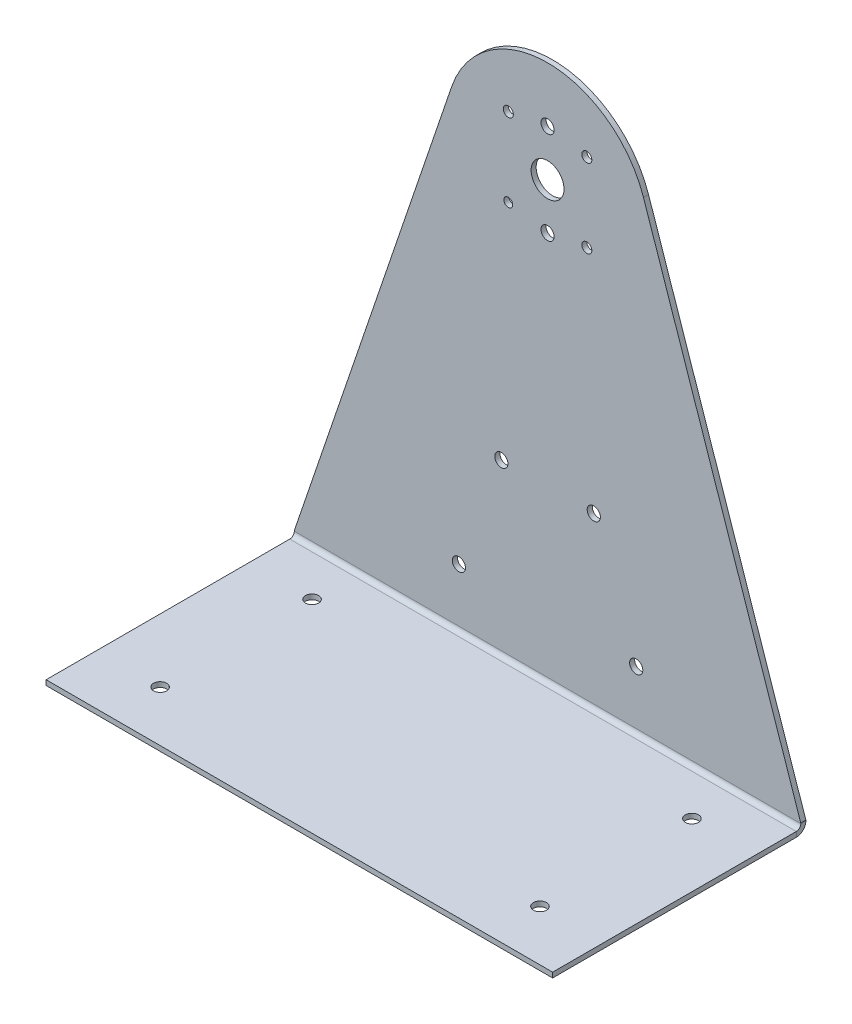
ISO-10303-21;
HEADER;
FILE_DESCRIPTION(('STEP AP214'),'2;1');
FILE_NAME('part.step','',(''),(''),'','','');
FILE_SCHEMA(('AUTOMOTIVE_DESIGN { 1 0 10303 214 1 1 1 1 }'));
ENDSEC;
DATA;
#1=APPLICATION_CONTEXT('core data for automotive mechanical design processes');
#2=APPLICATION_PROTOCOL_DEFINITION('international standard','automotive_design',2000,#1);
#3=PRODUCT_CONTEXT('',#1,'mechanical');
#4=PRODUCT('Part','Part','',(#3));
#5=PRODUCT_RELATED_PRODUCT_CATEGORY('part','',(#4));
#6=PRODUCT_DEFINITION_FORMATION('','',#4);
#7=PRODUCT_DEFINITION_CONTEXT('part definition',#1,'design');
#8=PRODUCT_DEFINITION('design','',#6,#7);
#9=PRODUCT_DEFINITION_SHAPE('','',#8);
#10=(LENGTH_UNIT() NAMED_UNIT(*) SI_UNIT(.MILLI.,.METRE.));
#11=(NAMED_UNIT(*) PLANE_ANGLE_UNIT() SI_UNIT($,.RADIAN.));
#12=(NAMED_UNIT(*) SI_UNIT($,.STERADIAN.) SOLID_ANGLE_UNIT());
#13=UNCERTAINTY_MEASURE_WITH_UNIT(LENGTH_MEASURE(1.E-05),#10,'distance_accuracy_value','');
#14=(GEOMETRIC_REPRESENTATION_CONTEXT(3) GLOBAL_UNCERTAINTY_ASSIGNED_CONTEXT((#13)) GLOBAL_UNIT_ASSIGNED_CONTEXT((#10,
#11,#12)) REPRESENTATION_CONTEXT('',''));
#15=CARTESIAN_POINT('',(0.,0.,0.));
#16=DIRECTION('',(0.,0.,1.));
#17=DIRECTION('',(1.,0.,0.));
#18=AXIS2_PLACEMENT_3D('',#15,#16,#17);
#19=CARTESIAN_POINT('',(100.,-3.99999999999996,4.));
#20=DIRECTION('',(-1.,0.,0.));
#21=DIRECTION('',(0.,0.,-1.));
#22=AXIS2_PLACEMENT_3D('',#19,#20,#21);
#23=PLANE('',#22);
#24=DIRECTION('',(0.,-1.,0.));
#25=VECTOR('',#24,1.);
#26=CARTESIAN_POINT('',(100.,-3.99999999999996,3.8));
#27=LINE('',#26,#25);
#28=CARTESIAN_POINT('',(100.,-1.99999999999996,3.8));
#29=VERTEX_POINT('',#28);
#30=CARTESIAN_POINT('',(100.,-3.99999999999996,3.8));
#31=VERTEX_POINT('',#30);
#32=EDGE_CURVE('E12',#29,#31,#27,.T.);
#33=ORIENTED_EDGE('',*,*,#32,.F.);
#34=DIRECTION('',(0.,0.,1.));
#35=VECTOR('',#34,1.);
#36=CARTESIAN_POINT('',(100.,-1.99999999999996,4.));
#37=LINE('',#36,#35);
#38=CARTESIAN_POINT('',(100.,-1.99999999999996,100.));
#39=VERTEX_POINT('',#38);
#40=EDGE_CURVE('E117',#39,#29,#37,.F.);
#41=ORIENTED_EDGE('',*,*,#40,.F.);
#42=DIRECTION('',(0.,-1.,0.));
#43=VECTOR('',#42,1.);
#44=CARTESIAN_POINT('',(100.,-3.99999999999996,100.));
#45=LINE('',#44,#43);
#46=CARTESIAN_POINT('',(100.,-3.99999999999996,100.));
#47=VERTEX_POINT('',#46);
#48=EDGE_CURVE('E363',#39,#47,#45,.T.);
#49=ORIENTED_EDGE('',*,*,#48,.T.);
#50=DIRECTION('',(0.,0.,-1.));
#51=VECTOR('',#50,1.);
#52=CARTESIAN_POINT('',(100.,-3.99999999999996,4.));
#53=LINE('',#52,#51);
#54=EDGE_CURVE('E337',#47,#31,#53,.T.);
#55=ORIENTED_EDGE('',*,*,#54,.T.);
#56=EDGE_LOOP('',(#33,#41,#49,#55));
#57=FACE_BOUND('',#56,.T.);
#58=ADVANCED_FACE('F103',(#57),#23,.F.);
#59=CARTESIAN_POINT('',(100.,-3.99999999999996,100.));
#60=DIRECTION('',(0.,0.,1.));
#61=DIRECTION('',(-1.,0.,0.));
#62=AXIS2_PLACEMENT_3D('',#59,#60,#61);
#63=PLANE('',#62);
#64=ORIENTED_EDGE('',*,*,#48,.F.);
#65=DIRECTION('',(1.,0.,0.));
#66=VECTOR('',#65,1.);
#67=CARTESIAN_POINT('',(100.,-1.99999999999996,100.));
#68=LINE('',#67,#66);
#69=CARTESIAN_POINT('',(-100.,-2.00000000000002,100.));
#70=VERTEX_POINT('',#69);
#71=EDGE_CURVE('E358',#39,#70,#68,.F.);
#72=ORIENTED_EDGE('',*,*,#71,.T.);
#73=DIRECTION('',(0.,-1.,0.));
#74=VECTOR('',#73,1.);
#75=CARTESIAN_POINT('',(-100.,-4.00000000000002,100.));
#76=LINE('',#75,#74);
#77=CARTESIAN_POINT('',(-100.,-4.00000000000002,100.));
#78=VERTEX_POINT('',#77);
#79=EDGE_CURVE('E345',#70,#78,#76,.T.);
#80=ORIENTED_EDGE('',*,*,#79,.T.);
#81=DIRECTION('',(-1.,0.,0.));
#82=VECTOR('',#81,1.);
#83=CARTESIAN_POINT('',(100.,-3.99999999999996,100.));
#84=LINE('',#83,#82);
#85=EDGE_CURVE('E340',#47,#78,#84,.T.);
#86=ORIENTED_EDGE('',*,*,#85,.F.);
#87=EDGE_LOOP('',(#64,#72,#80,#86));
#88=FACE_BOUND('',#87,.T.);
#89=ADVANCED_FACE('F379',(#88),#63,.T.);
#90=CARTESIAN_POINT('',(-100.,-4.00000000000002,4.));
#91=DIRECTION('',(-1.,0.,0.));
#92=DIRECTION('',(0.,0.,-1.));
#93=AXIS2_PLACEMENT_3D('',#90,#91,#92);
#94=PLANE('',#93);
#95=ORIENTED_EDGE('',*,*,#79,.F.);
#96=DIRECTION('',(0.,0.,1.));
#97=VECTOR('',#96,1.);
#98=CARTESIAN_POINT('',(-100.,-2.00000000000002,4.));
#99=LINE('',#98,#97);
#100=CARTESIAN_POINT('',(-100.,-2.00000000000002,3.8));
#101=VERTEX_POINT('',#100);
#102=EDGE_CURVE('E125',#70,#101,#99,.F.);
#103=ORIENTED_EDGE('',*,*,#102,.T.);
#104=DIRECTION('',(0.,-1.,0.));
#105=VECTOR('',#104,1.);
#106=CARTESIAN_POINT('',(-100.,-4.00000000000002,3.8));
#107=LINE('',#106,#105);
#108=CARTESIAN_POINT('',(-100.,-4.00000000000002,3.8));
#109=VERTEX_POINT('',#108);
#110=EDGE_CURVE('E366',#101,#109,#107,.T.);
#111=ORIENTED_EDGE('',*,*,#110,.T.);
#112=DIRECTION('',(0.,0.,-1.));
#113=VECTOR('',#112,1.);
#114=CARTESIAN_POINT('',(-100.,-4.00000000000002,4.));
#115=LINE('',#114,#113);
#116=EDGE_CURVE('E343',#78,#109,#115,.T.);
#117=ORIENTED_EDGE('',*,*,#116,.F.);
#118=EDGE_LOOP('',(#95,#103,#111,#117));
#119=FACE_BOUND('',#118,.T.);
#120=ADVANCED_FACE('F373',(#119),#94,.T.);
#121=CARTESIAN_POINT('',(-75.,-4.00000000000002,20.));
#122=DIRECTION('',(0.,-1.,0.));
#123=DIRECTION('',(1.,0.,0.));
#124=AXIS2_PLACEMENT_3D('',#121,#122,#123);
#125=CYLINDRICAL_SURFACE('',#124,2.6);
#126=CARTESIAN_POINT('',(-75.,-4.00000000000002,20.));
#127=DIRECTION('',(0.,-1.,0.));
#128=DIRECTION('',(1.,0.,0.));
#129=AXIS2_PLACEMENT_3D('',#126,#127,#128);
#130=CIRCLE('',#129,2.6);
#131=CARTESIAN_POINT('',(-72.4,-4.00000000000002,20.));
#132=VERTEX_POINT('',#131);
#133=EDGE_CURVE('E325',#132,#132,#130,.T.);
#134=ORIENTED_EDGE('',*,*,#133,.T.);
#135=EDGE_LOOP('',(#134));
#136=FACE_BOUND('',#135,.T.);
#137=CARTESIAN_POINT('',(-75.,-2.00000000000002,20.));
#138=DIRECTION('',(0.,-1.,0.));
#139=DIRECTION('',(1.,0.,0.));
#140=AXIS2_PLACEMENT_3D('',#137,#138,#139);
#141=CIRCLE('',#140,2.6);
#142=CARTESIAN_POINT('',(-72.4,-2.00000000000002,20.));
#143=VERTEX_POINT('',#142);
#144=EDGE_CURVE('E231',#143,#143,#141,.T.);
#145=ORIENTED_EDGE('',*,*,#144,.F.);
#146=EDGE_LOOP('',(#145));
#147=FACE_BOUND('',#146,.T.);
#148=ADVANCED_FACE('F417',(#136,#147),#125,.F.);
#149=CARTESIAN_POINT('',(75.,-3.99999999999998,80.));
#150=DIRECTION('',(0.,-1.,0.));
#151=DIRECTION('',(1.,0.,0.));
#152=AXIS2_PLACEMENT_3D('',#149,#150,#151);
#153=CYLINDRICAL_SURFACE('',#152,2.6);
#154=CARTESIAN_POINT('',(75.,-3.99999999999998,80.));
#155=DIRECTION('',(0.,-1.,0.));
#156=DIRECTION('',(1.,0.,0.));
#157=AXIS2_PLACEMENT_3D('',#154,#155,#156);
#158=CIRCLE('',#157,2.6);
#159=CARTESIAN_POINT('',(77.6,-3.99999999999997,80.));
#160=VERTEX_POINT('',#159);
#161=EDGE_CURVE('E328',#160,#160,#158,.T.);
#162=ORIENTED_EDGE('',*,*,#161,.T.);
#163=EDGE_LOOP('',(#162));
#164=FACE_BOUND('',#163,.T.);
#165=CARTESIAN_POINT('',(75.,-1.99999999999998,80.));
#166=DIRECTION('',(0.,-1.,0.));
#167=DIRECTION('',(1.,0.,0.));
#168=AXIS2_PLACEMENT_3D('',#165,#166,#167);
#169=CIRCLE('',#168,2.6);
#170=CARTESIAN_POINT('',(77.6,-1.99999999999998,80.));
#171=VERTEX_POINT('',#170);
#172=EDGE_CURVE('E348',#171,#171,#169,.T.);
#173=ORIENTED_EDGE('',*,*,#172,.F.);
#174=EDGE_LOOP('',(#173));
#175=FACE_BOUND('',#174,.T.);
#176=ADVANCED_FACE('F427',(#164,#175),#153,.F.);
#177=CARTESIAN_POINT('',(75.,-3.99999999999998,20.));
#178=DIRECTION('',(0.,-1.,0.));
#179=DIRECTION('',(1.,0.,0.));
#180=AXIS2_PLACEMENT_3D('',#177,#178,#179);
#181=CYLINDRICAL_SURFACE('',#180,2.6);
#182=CARTESIAN_POINT('',(75.,-3.99999999999998,20.));
#183=DIRECTION('',(0.,-1.,0.));
#184=DIRECTION('',(1.,0.,0.));
#185=AXIS2_PLACEMENT_3D('',#182,#183,#184);
#186=CIRCLE('',#185,2.6);
#187=CARTESIAN_POINT('',(77.6,-3.99999999999998,20.));
#188=VERTEX_POINT('',#187);
#189=EDGE_CURVE('E331',#188,#188,#186,.T.);
#190=ORIENTED_EDGE('',*,*,#189,.T.);
#191=EDGE_LOOP('',(#190));
#192=FACE_BOUND('',#191,.T.);
#193=CARTESIAN_POINT('',(75.,-1.99999999999998,20.));
#194=DIRECTION('',(0.,-1.,0.));
#195=DIRECTION('',(1.,0.,0.));
#196=AXIS2_PLACEMENT_3D('',#193,#194,#195);
#197=CIRCLE('',#196,2.6);
#198=CARTESIAN_POINT('',(77.6,-1.99999999999997,20.));
#199=VERTEX_POINT('',#198);
#200=EDGE_CURVE('E351',#199,#199,#197,.T.);
#201=ORIENTED_EDGE('',*,*,#200,.F.);
#202=EDGE_LOOP('',(#201));
#203=FACE_BOUND('',#202,.T.);
#204=ADVANCED_FACE('F423',(#192,#203),#181,.F.);
#205=CARTESIAN_POINT('',(-75.,-4.00000000000002,80.));
#206=DIRECTION('',(0.,-1.,0.));
#207=DIRECTION('',(1.,0.,0.));
#208=AXIS2_PLACEMENT_3D('',#205,#206,#207);
#209=CYLINDRICAL_SURFACE('',#208,2.6);
#210=CARTESIAN_POINT('',(-75.,-4.00000000000002,80.));
#211=DIRECTION('',(0.,-1.,0.));
#212=DIRECTION('',(1.,0.,0.));
#213=AXIS2_PLACEMENT_3D('',#210,#211,#212);
#214=CIRCLE('',#213,2.6);
#215=CARTESIAN_POINT('',(-72.4,-4.00000000000002,80.));
#216=VERTEX_POINT('',#215);
#217=EDGE_CURVE('E334',#216,#216,#214,.T.);
#218=ORIENTED_EDGE('',*,*,#217,.T.);
#219=EDGE_LOOP('',(#218));
#220=FACE_BOUND('',#219,.T.);
#221=CARTESIAN_POINT('',(-75.,-2.00000000000002,80.));
#222=DIRECTION('',(0.,-1.,0.));
#223=DIRECTION('',(1.,0.,0.));
#224=AXIS2_PLACEMENT_3D('',#221,#222,#223);
#225=CIRCLE('',#224,2.6);
#226=CARTESIAN_POINT('',(-72.4,-2.00000000000002,80.));
#227=VERTEX_POINT('',#226);
#228=EDGE_CURVE('E354',#227,#227,#225,.T.);
#229=ORIENTED_EDGE('',*,*,#228,.F.);
#230=EDGE_LOOP('',(#229));
#231=FACE_BOUND('',#230,.T.);
#232=ADVANCED_FACE('F420',(#220,#231),#209,.F.);
#233=CARTESIAN_POINT('',(100.,-3.99999999999996,4.));
#234=DIRECTION('',(0.,-1.,0.));
#235=DIRECTION('',(1.,0.,0.));
#236=AXIS2_PLACEMENT_3D('',#233,#234,#235);
#237=PLANE('',#236);
#238=ORIENTED_EDGE('',*,*,#133,.F.);
#239=EDGE_LOOP('',(#238));
#240=FACE_BOUND('',#239,.T.);
#241=ORIENTED_EDGE('',*,*,#161,.F.);
#242=EDGE_LOOP('',(#241));
#243=FACE_BOUND('',#242,.T.);
#244=ORIENTED_EDGE('',*,*,#189,.F.);
#245=EDGE_LOOP('',(#244));
#246=FACE_BOUND('',#245,.T.);
#247=ORIENTED_EDGE('',*,*,#217,.F.);
#248=EDGE_LOOP('',(#247));
#249=FACE_BOUND('',#248,.T.);
#250=ORIENTED_EDGE('',*,*,#116,.T.);
#251=DIRECTION('',(1.,0.,0.));
#252=VECTOR('',#251,1.);
#253=CARTESIAN_POINT('',(100.,-3.99999999999996,3.8));
#254=LINE('',#253,#252);
#255=EDGE_CURVE('E220',#109,#31,#254,.T.);
#256=ORIENTED_EDGE('',*,*,#255,.T.);
#257=ORIENTED_EDGE('',*,*,#54,.F.);
#258=ORIENTED_EDGE('',*,*,#85,.T.);
#259=EDGE_LOOP('',(#250,#256,#257,#258));
#260=FACE_BOUND('',#259,.T.);
#261=ADVANCED_FACE('F375',(#240,#243,#246,#249,#260),#237,.T.);
#262=CARTESIAN_POINT('',(100.,-1.99999999999996,4.));
#263=DIRECTION('',(0.,-1.,0.));
#264=DIRECTION('',(1.,0.,0.));
#265=AXIS2_PLACEMENT_3D('',#262,#263,#264);
#266=PLANE('',#265);
#267=ORIENTED_EDGE('',*,*,#144,.T.);
#268=EDGE_LOOP('',(#267));
#269=FACE_BOUND('',#268,.T.);
#270=ORIENTED_EDGE('',*,*,#172,.T.);
#271=EDGE_LOOP('',(#270));
#272=FACE_BOUND('',#271,.T.);
#273=ORIENTED_EDGE('',*,*,#200,.T.);
#274=EDGE_LOOP('',(#273));
#275=FACE_BOUND('',#274,.T.);
#276=ORIENTED_EDGE('',*,*,#228,.T.);
#277=EDGE_LOOP('',(#276));
#278=FACE_BOUND('',#277,.T.);
#279=ORIENTED_EDGE('',*,*,#102,.F.);
#280=ORIENTED_EDGE('',*,*,#71,.F.);
#281=ORIENTED_EDGE('',*,*,#40,.T.);
#282=DIRECTION('',(1.,0.,0.));
#283=VECTOR('',#282,1.);
#284=CARTESIAN_POINT('',(100.,-1.99999999999996,3.8));
#285=LINE('',#284,#283);
#286=EDGE_CURVE('E110',#101,#29,#285,.T.);
#287=ORIENTED_EDGE('',*,*,#286,.F.);
#288=EDGE_LOOP('',(#279,#280,#281,#287));
#289=FACE_BOUND('',#288,.T.);
#290=ADVANCED_FACE('F371',(#269,#272,#275,#278,#289),#266,.F.);
#291=CARTESIAN_POINT('',(89.6524360568104,30.4579105448907,0.));
#292=DIRECTION('',(0.946849703262405,0.321676296036708,0.));
#293=DIRECTION('',(-0.321676296036708,0.946849703262405,0.));
#294=AXIS2_PLACEMENT_3D('',#291,#292,#293);
#295=PLANE('',#294);
#296=DIRECTION('',(0.,0.,-1.));
#297=VECTOR('',#296,1.);
#298=CARTESIAN_POINT('',(37.8739881304963,182.867051841468,0.));
#299=LINE('',#298,#297);
#300=CARTESIAN_POINT('',(37.8739881304963,182.867051841468,2.));
#301=VERTEX_POINT('',#300);
#302=CARTESIAN_POINT('',(37.8739881304963,182.867051841468,0.));
#303=VERTEX_POINT('',#302);
#304=EDGE_CURVE('E318',#301,#303,#299,.T.);
#305=ORIENTED_EDGE('',*,*,#304,.F.);
#306=DIRECTION('',(-0.321676296036708,0.946849703262405,0.));
#307=VECTOR('',#306,1.);
#308=CARTESIAN_POINT('',(89.6524360568104,30.4579105448907,2.));
#309=LINE('',#308,#307);
#310=CARTESIAN_POINT('',(100.,0.,2.));
#311=VERTEX_POINT('',#310);
#312=EDGE_CURVE('E239',#311,#301,#309,.T.);
#313=ORIENTED_EDGE('',*,*,#312,.F.);
#314=DIRECTION('',(0.,0.,-1.));
#315=VECTOR('',#314,1.);
#316=CARTESIAN_POINT('',(100.,0.,0.));
#317=LINE('',#316,#315);
#318=CARTESIAN_POINT('',(100.,0.,0.));
#319=VERTEX_POINT('',#318);
#320=EDGE_CURVE('E216',#311,#319,#317,.T.);
#321=ORIENTED_EDGE('',*,*,#320,.T.);
#322=DIRECTION('',(-0.321676296036708,0.946849703262405,0.));
#323=VECTOR('',#322,1.);
#324=CARTESIAN_POINT('',(89.6524360568104,30.4579105448907,0.));
#325=LINE('',#324,#323);
#326=EDGE_CURVE('E320',#319,#303,#325,.T.);
#327=ORIENTED_EDGE('',*,*,#326,.T.);
#328=EDGE_LOOP('',(#305,#313,#321,#327));
#329=FACE_BOUND('',#328,.T.);
#330=ADVANCED_FACE('F399',(#329),#295,.T.);
#331=CARTESIAN_POINT('',(0.,170.,0.));
#332=DIRECTION('',(0.,0.,1.));
#333=DIRECTION('',(1.,0.,0.));
#334=AXIS2_PLACEMENT_3D('',#331,#332,#333);
#335=CYLINDRICAL_SURFACE('',#334,40.);
#336=DIRECTION('',(0.,0.,-1.));
#337=VECTOR('',#336,1.);
#338=CARTESIAN_POINT('',(-37.8739881304963,182.867051841468,0.));
#339=LINE('',#338,#337);
#340=CARTESIAN_POINT('',(-37.8739881304963,182.867051841468,2.));
#341=VERTEX_POINT('',#340);
#342=CARTESIAN_POINT('',(-37.8739881304963,182.867051841468,0.));
#343=VERTEX_POINT('',#342);
#344=EDGE_CURVE('E310',#341,#343,#339,.T.);
#345=ORIENTED_EDGE('',*,*,#344,.F.);
#346=CARTESIAN_POINT('',(0.,170.,2.));
#347=DIRECTION('',(0.,0.,1.));
#348=DIRECTION('',(1.,0.,0.));
#349=AXIS2_PLACEMENT_3D('',#346,#347,#348);
#350=CIRCLE('',#349,40.);
#351=EDGE_CURVE('E236',#301,#341,#350,.T.);
#352=ORIENTED_EDGE('',*,*,#351,.F.);
#353=ORIENTED_EDGE('',*,*,#304,.T.);
#354=CARTESIAN_POINT('',(0.,170.,0.));
#355=DIRECTION('',(0.,0.,1.));
#356=DIRECTION('',(1.,0.,0.));
#357=AXIS2_PLACEMENT_3D('',#354,#355,#356);
#358=CIRCLE('',#357,40.);
#359=EDGE_CURVE('E315',#303,#343,#358,.T.);
#360=ORIENTED_EDGE('',*,*,#359,.T.);
#361=EDGE_LOOP('',(#345,#352,#353,#360));
#362=FACE_BOUND('',#361,.T.);
#363=ADVANCED_FACE('F397',(#362),#335,.T.);
#364=CARTESIAN_POINT('',(-89.6524360568104,30.4579105448907,0.));
#365=DIRECTION('',(0.946849703262405,-0.321676296036708,0.));
#366=DIRECTION('',(0.321676296036708,0.946849703262405,0.));
#367=AXIS2_PLACEMENT_3D('',#364,#365,#366);
#368=PLANE('',#367);
#369=DIRECTION('',(0.,0.,-1.));
#370=VECTOR('',#369,1.);
#371=CARTESIAN_POINT('',(-100.,0.,0.));
#372=LINE('',#371,#370);
#373=CARTESIAN_POINT('',(-100.,0.,2.));
#374=VERTEX_POINT('',#373);
#375=CARTESIAN_POINT('',(-100.,0.,0.));
#376=VERTEX_POINT('',#375);
#377=EDGE_CURVE('E188',#374,#376,#372,.T.);
#378=ORIENTED_EDGE('',*,*,#377,.F.);
#379=DIRECTION('',(0.321676296036708,0.946849703262405,0.));
#380=VECTOR('',#379,1.);
#381=CARTESIAN_POINT('',(-89.6524360568104,30.4579105448907,2.));
#382=LINE('',#381,#380);
#383=EDGE_CURVE('E312',#374,#341,#382,.T.);
#384=ORIENTED_EDGE('',*,*,#383,.T.);
#385=ORIENTED_EDGE('',*,*,#344,.T.);
#386=DIRECTION('',(0.321676296036708,0.946849703262405,0.));
#387=VECTOR('',#386,1.);
#388=CARTESIAN_POINT('',(-89.6524360568104,30.4579105448907,0.));
#389=LINE('',#388,#387);
#390=EDGE_CURVE('E205',#376,#343,#389,.T.);
#391=ORIENTED_EDGE('',*,*,#390,.F.);
#392=EDGE_LOOP('',(#378,#384,#385,#391));
#393=FACE_BOUND('',#392,.T.);
#394=ADVANCED_FACE('F394',(#393),#368,.F.);
#395=CARTESIAN_POINT('',(0.,170.,0.));
#396=DIRECTION('',(0.,0.,1.));
#397=DIRECTION('',(1.,0.,0.));
#398=AXIS2_PLACEMENT_3D('',#395,#396,#397);
#399=CYLINDRICAL_SURFACE('',#398,6.50000000000001);
#400=CARTESIAN_POINT('',(0.,170.,0.));
#401=DIRECTION('',(0.,0.,1.));
#402=DIRECTION('',(1.,0.,0.));
#403=AXIS2_PLACEMENT_3D('',#400,#401,#402);
#404=CIRCLE('',#403,6.50000000000001);
#405=CARTESIAN_POINT('',(6.50000000000001,170.,0.));
#406=VERTEX_POINT('',#405);
#407=EDGE_CURVE('E256',#406,#406,#404,.T.);
#408=ORIENTED_EDGE('',*,*,#407,.F.);
#409=EDGE_LOOP('',(#408));
#410=FACE_BOUND('',#409,.T.);
#411=CARTESIAN_POINT('',(0.,170.,2.));
#412=DIRECTION('',(0.,0.,1.));
#413=DIRECTION('',(1.,0.,0.));
#414=AXIS2_PLACEMENT_3D('',#411,#412,#413);
#415=CIRCLE('',#414,6.50000000000001);
#416=CARTESIAN_POINT('',(6.50000000000001,170.,2.));
#417=VERTEX_POINT('',#416);
#418=EDGE_CURVE('E307',#417,#417,#415,.T.);
#419=ORIENTED_EDGE('',*,*,#418,.T.);
#420=EDGE_LOOP('',(#419));
#421=FACE_BOUND('',#420,.T.);
#422=ADVANCED_FACE('F487',(#410,#421),#399,.F.);
#423=CARTESIAN_POINT('',(0.,151.75,0.));
#424=DIRECTION('',(0.,0.,1.));
#425=DIRECTION('',(1.,0.,0.));
#426=AXIS2_PLACEMENT_3D('',#423,#424,#425);
#427=CYLINDRICAL_SURFACE('',#426,2.59999999999999);
#428=CARTESIAN_POINT('',(0.,151.75,0.));
#429=DIRECTION('',(0.,0.,-1.));
#430=DIRECTION('',(-1.,0.,0.));
#431=AXIS2_PLACEMENT_3D('',#428,#429,#430);
#432=CIRCLE('',#431,2.59999999999999);
#433=CARTESIAN_POINT('',(-2.6,151.75,0.));
#434=VERTEX_POINT('',#433);
#435=EDGE_CURVE('E304',#434,#434,#432,.T.);
#436=ORIENTED_EDGE('',*,*,#435,.T.);
#437=EDGE_LOOP('',(#436));
#438=FACE_BOUND('',#437,.T.);
#439=CARTESIAN_POINT('',(0.,151.75,2.));
#440=DIRECTION('',(0.,0.,-1.));
#441=DIRECTION('',(-1.,0.,0.));
#442=AXIS2_PLACEMENT_3D('',#439,#440,#441);
#443=CIRCLE('',#442,2.59999999999999);
#444=CARTESIAN_POINT('',(-2.6,151.75,2.));
#445=VERTEX_POINT('',#444);
#446=EDGE_CURVE('E242',#445,#445,#443,.T.);
#447=ORIENTED_EDGE('',*,*,#446,.F.);
#448=EDGE_LOOP('',(#447));
#449=FACE_BOUND('',#448,.T.);
#450=ADVANCED_FACE('F483',(#438,#449),#427,.F.);
#451=CARTESIAN_POINT('',(0.,188.25,0.));
#452=DIRECTION('',(0.,0.,1.));
#453=DIRECTION('',(1.,0.,0.));
#454=AXIS2_PLACEMENT_3D('',#451,#452,#453);
#455=CYLINDRICAL_SURFACE('',#454,2.6);
#456=CARTESIAN_POINT('',(0.,188.25,0.));
#457=DIRECTION('',(0.,0.,-1.));
#458=DIRECTION('',(-1.,0.,0.));
#459=AXIS2_PLACEMENT_3D('',#456,#457,#458);
#460=CIRCLE('',#459,2.6);
#461=CARTESIAN_POINT('',(-2.59999999999999,188.25,0.));
#462=VERTEX_POINT('',#461);
#463=EDGE_CURVE('E301',#462,#462,#460,.T.);
#464=ORIENTED_EDGE('',*,*,#463,.T.);
#465=EDGE_LOOP('',(#464));
#466=FACE_BOUND('',#465,.T.);
#467=CARTESIAN_POINT('',(0.,188.25,2.));
#468=DIRECTION('',(0.,0.,-1.));
#469=DIRECTION('',(-1.,0.,0.));
#470=AXIS2_PLACEMENT_3D('',#467,#468,#469);
#471=CIRCLE('',#470,2.6);
#472=CARTESIAN_POINT('',(-2.59999999999999,188.25,2.));
#473=VERTEX_POINT('',#472);
#474=EDGE_CURVE('E245',#473,#473,#471,.T.);
#475=ORIENTED_EDGE('',*,*,#474,.F.);
#476=EDGE_LOOP('',(#475));
#477=FACE_BOUND('',#476,.T.);
#478=ADVANCED_FACE('F479',(#466,#477),#455,.F.);
#479=CARTESIAN_POINT('',(-18.25,65.,0.));
#480=DIRECTION('',(0.,0.,1.));
#481=DIRECTION('',(1.,0.,0.));
#482=AXIS2_PLACEMENT_3D('',#479,#480,#481);
#483=CYLINDRICAL_SURFACE('',#482,2.6);
#484=CARTESIAN_POINT('',(-18.25,65.,0.));
#485=DIRECTION('',(0.,0.,-1.));
#486=DIRECTION('',(-1.,0.,0.));
#487=AXIS2_PLACEMENT_3D('',#484,#485,#486);
#488=CIRCLE('',#487,2.6);
#489=CARTESIAN_POINT('',(-20.85,65.,0.));
#490=VERTEX_POINT('',#489);
#491=EDGE_CURVE('E298',#490,#490,#488,.T.);
#492=ORIENTED_EDGE('',*,*,#491,.T.);
#493=EDGE_LOOP('',(#492));
#494=FACE_BOUND('',#493,.T.);
#495=CARTESIAN_POINT('',(-18.25,65.,2.));
#496=DIRECTION('',(0.,0.,-1.));
#497=DIRECTION('',(-1.,0.,0.));
#498=AXIS2_PLACEMENT_3D('',#495,#496,#497);
#499=CIRCLE('',#498,2.6);
#500=CARTESIAN_POINT('',(-20.85,65.,2.));
#501=VERTEX_POINT('',#500);
#502=EDGE_CURVE('E248',#501,#501,#499,.T.);
#503=ORIENTED_EDGE('',*,*,#502,.F.);
#504=EDGE_LOOP('',(#503));
#505=FACE_BOUND('',#504,.T.);
#506=ADVANCED_FACE('F475',(#494,#505),#483,.F.);
#507=CARTESIAN_POINT('',(18.25,65.,0.));
#508=DIRECTION('',(0.,0.,1.));
#509=DIRECTION('',(1.,0.,0.));
#510=AXIS2_PLACEMENT_3D('',#507,#508,#509);
#511=CYLINDRICAL_SURFACE('',#510,2.6);
#512=CARTESIAN_POINT('',(18.25,65.,0.));
#513=DIRECTION('',(0.,0.,-1.));
#514=DIRECTION('',(-1.,0.,0.));
#515=AXIS2_PLACEMENT_3D('',#512,#513,#514);
#516=CIRCLE('',#515,2.6);
#517=CARTESIAN_POINT('',(15.65,65.,0.));
#518=VERTEX_POINT('',#517);
#519=EDGE_CURVE('E295',#518,#518,#516,.T.);
#520=ORIENTED_EDGE('',*,*,#519,.T.);
#521=EDGE_LOOP('',(#520));
#522=FACE_BOUND('',#521,.T.);
#523=CARTESIAN_POINT('',(18.25,65.,2.));
#524=DIRECTION('',(0.,0.,-1.));
#525=DIRECTION('',(-1.,0.,0.));
#526=AXIS2_PLACEMENT_3D('',#523,#524,#525);
#527=CIRCLE('',#526,2.6);
#528=CARTESIAN_POINT('',(15.65,65.,2.));
#529=VERTEX_POINT('',#528);
#530=EDGE_CURVE('E192',#529,#529,#527,.T.);
#531=ORIENTED_EDGE('',*,*,#530,.F.);
#532=EDGE_LOOP('',(#531));
#533=FACE_BOUND('',#532,.T.);
#534=ADVANCED_FACE('F471',(#522,#533),#511,.F.);
#535=CARTESIAN_POINT('',(35.,21.,0.));
#536=DIRECTION('',(0.,0.,1.));
#537=DIRECTION('',(1.,0.,0.));
#538=AXIS2_PLACEMENT_3D('',#535,#536,#537);
#539=CYLINDRICAL_SURFACE('',#538,2.6);
#540=CARTESIAN_POINT('',(35.,21.,0.));
#541=DIRECTION('',(0.,0.,1.));
#542=DIRECTION('',(1.,0.,0.));
#543=AXIS2_PLACEMENT_3D('',#540,#541,#542);
#544=CIRCLE('',#543,2.6);
#545=CARTESIAN_POINT('',(37.6,21.,0.));
#546=VERTEX_POINT('',#545);
#547=EDGE_CURVE('E259',#546,#546,#544,.T.);
#548=ORIENTED_EDGE('',*,*,#547,.F.);
#549=EDGE_LOOP('',(#548));
#550=FACE_BOUND('',#549,.T.);
#551=CARTESIAN_POINT('',(35.,21.,2.));
#552=DIRECTION('',(0.,0.,1.));
#553=DIRECTION('',(1.,0.,0.));
#554=AXIS2_PLACEMENT_3D('',#551,#552,#553);
#555=CIRCLE('',#554,2.6);
#556=CARTESIAN_POINT('',(37.6,21.,2.));
#557=VERTEX_POINT('',#556);
#558=EDGE_CURVE('E292',#557,#557,#555,.T.);
#559=ORIENTED_EDGE('',*,*,#558,.T.);
#560=EDGE_LOOP('',(#559));
#561=FACE_BOUND('',#560,.T.);
#562=ADVANCED_FACE('F467',(#550,#561),#539,.F.);
#563=CARTESIAN_POINT('',(-35.,21.,0.));
#564=DIRECTION('',(0.,0.,1.));
#565=DIRECTION('',(1.,0.,0.));
#566=AXIS2_PLACEMENT_3D('',#563,#564,#565);
#567=CYLINDRICAL_SURFACE('',#566,2.6);
#568=CARTESIAN_POINT('',(-35.,21.,0.));
#569=DIRECTION('',(0.,0.,1.));
#570=DIRECTION('',(1.,0.,0.));
#571=AXIS2_PLACEMENT_3D('',#568,#569,#570);
#572=CIRCLE('',#571,2.6);
#573=CARTESIAN_POINT('',(-32.4,21.,0.));
#574=VERTEX_POINT('',#573);
#575=EDGE_CURVE('E262',#574,#574,#572,.T.);
#576=ORIENTED_EDGE('',*,*,#575,.F.);
#577=EDGE_LOOP('',(#576));
#578=FACE_BOUND('',#577,.T.);
#579=CARTESIAN_POINT('',(-35.,21.,2.));
#580=DIRECTION('',(0.,0.,1.));
#581=DIRECTION('',(1.,0.,0.));
#582=AXIS2_PLACEMENT_3D('',#579,#580,#581);
#583=CIRCLE('',#582,2.6);
#584=CARTESIAN_POINT('',(-32.4,21.,2.));
#585=VERTEX_POINT('',#584);
#586=EDGE_CURVE('E289',#585,#585,#583,.T.);
#587=ORIENTED_EDGE('',*,*,#586,.T.);
#588=EDGE_LOOP('',(#587));
#589=FACE_BOUND('',#588,.T.);
#590=ADVANCED_FACE('F463',(#578,#589),#567,.F.);
#591=CARTESIAN_POINT('',(-15.5,185.5,0.));
#592=DIRECTION('',(0.,0.,1.));
#593=DIRECTION('',(1.,0.,0.));
#594=AXIS2_PLACEMENT_3D('',#591,#592,#593);
#595=CYLINDRICAL_SURFACE('',#594,1.97872079457994);
#596=CARTESIAN_POINT('',(-15.5,185.5,0.));
#597=DIRECTION('',(0.,0.,1.));
#598=DIRECTION('',(1.,0.,0.));
#599=AXIS2_PLACEMENT_3D('',#596,#597,#598);
#600=CIRCLE('',#599,1.97872079457994);
#601=CARTESIAN_POINT('',(-13.5212792054201,185.5,0.));
#602=VERTEX_POINT('',#601);
#603=EDGE_CURVE('E265',#602,#602,#600,.T.);
#604=ORIENTED_EDGE('',*,*,#603,.F.);
#605=EDGE_LOOP('',(#604));
#606=FACE_BOUND('',#605,.T.);
#607=CARTESIAN_POINT('',(-15.5,185.5,2.));
#608=DIRECTION('',(0.,0.,1.));
#609=DIRECTION('',(1.,0.,0.));
#610=AXIS2_PLACEMENT_3D('',#607,#608,#609);
#611=CIRCLE('',#610,1.97872079457994);
#612=CARTESIAN_POINT('',(-13.5212792054201,185.5,2.));
#613=VERTEX_POINT('',#612);
#614=EDGE_CURVE('E286',#613,#613,#611,.T.);
#615=ORIENTED_EDGE('',*,*,#614,.T.);
#616=EDGE_LOOP('',(#615));
#617=FACE_BOUND('',#616,.T.);
#618=ADVANCED_FACE('F459',(#606,#617),#595,.F.);
#619=CARTESIAN_POINT('',(15.5,185.5,0.));
#620=DIRECTION('',(0.,0.,1.));
#621=DIRECTION('',(1.,0.,0.));
#622=AXIS2_PLACEMENT_3D('',#619,#620,#621);
#623=CYLINDRICAL_SURFACE('',#622,1.97872079457994);
#624=CARTESIAN_POINT('',(15.5,185.5,0.));
#625=DIRECTION('',(0.,0.,1.));
#626=DIRECTION('',(1.,0.,0.));
#627=AXIS2_PLACEMENT_3D('',#624,#625,#626);
#628=CIRCLE('',#627,1.97872079457994);
#629=CARTESIAN_POINT('',(17.4787207945799,185.5,0.));
#630=VERTEX_POINT('',#629);
#631=EDGE_CURVE('E268',#630,#630,#628,.T.);
#632=ORIENTED_EDGE('',*,*,#631,.F.);
#633=EDGE_LOOP('',(#632));
#634=FACE_BOUND('',#633,.T.);
#635=CARTESIAN_POINT('',(15.5,185.5,2.));
#636=DIRECTION('',(0.,0.,1.));
#637=DIRECTION('',(1.,0.,0.));
#638=AXIS2_PLACEMENT_3D('',#635,#636,#637);
#639=CIRCLE('',#638,1.97872079457994);
#640=CARTESIAN_POINT('',(17.4787207945799,185.5,2.));
#641=VERTEX_POINT('',#640);
#642=EDGE_CURVE('E283',#641,#641,#639,.T.);
#643=ORIENTED_EDGE('',*,*,#642,.T.);
#644=EDGE_LOOP('',(#643));
#645=FACE_BOUND('',#644,.T.);
#646=ADVANCED_FACE('F455',(#634,#645),#623,.F.);
#647=CARTESIAN_POINT('',(15.5,154.5,0.));
#648=DIRECTION('',(0.,0.,1.));
#649=DIRECTION('',(1.,0.,0.));
#650=AXIS2_PLACEMENT_3D('',#647,#648,#649);
#651=CYLINDRICAL_SURFACE('',#650,1.97872079457994);
#652=CARTESIAN_POINT('',(15.5,154.5,0.));
#653=DIRECTION('',(0.,0.,1.));
#654=DIRECTION('',(1.,0.,0.));
#655=AXIS2_PLACEMENT_3D('',#652,#653,#654);
#656=CIRCLE('',#655,1.97872079457994);
#657=CARTESIAN_POINT('',(17.4787207945799,154.5,0.));
#658=VERTEX_POINT('',#657);
#659=EDGE_CURVE('E271',#658,#658,#656,.T.);
#660=ORIENTED_EDGE('',*,*,#659,.F.);
#661=EDGE_LOOP('',(#660));
#662=FACE_BOUND('',#661,.T.);
#663=CARTESIAN_POINT('',(15.5,154.5,2.));
#664=DIRECTION('',(0.,0.,1.));
#665=DIRECTION('',(1.,0.,0.));
#666=AXIS2_PLACEMENT_3D('',#663,#664,#665);
#667=CIRCLE('',#666,1.97872079457994);
#668=CARTESIAN_POINT('',(17.4787207945799,154.5,2.));
#669=VERTEX_POINT('',#668);
#670=EDGE_CURVE('E280',#669,#669,#667,.T.);
#671=ORIENTED_EDGE('',*,*,#670,.T.);
#672=EDGE_LOOP('',(#671));
#673=FACE_BOUND('',#672,.T.);
#674=ADVANCED_FACE('F451',(#662,#673),#651,.F.);
#675=CARTESIAN_POINT('',(-15.5,154.5,0.));
#676=DIRECTION('',(0.,0.,1.));
#677=DIRECTION('',(1.,0.,0.));
#678=AXIS2_PLACEMENT_3D('',#675,#676,#677);
#679=CYLINDRICAL_SURFACE('',#678,1.75);
#680=CARTESIAN_POINT('',(-15.5,154.5,0.));
#681=DIRECTION('',(0.,0.,1.));
#682=DIRECTION('',(1.,0.,0.));
#683=AXIS2_PLACEMENT_3D('',#680,#681,#682);
#684=CIRCLE('',#683,1.75);
#685=CARTESIAN_POINT('',(-13.75,154.5,0.));
#686=VERTEX_POINT('',#685);
#687=EDGE_CURVE('E274',#686,#686,#684,.T.);
#688=ORIENTED_EDGE('',*,*,#687,.F.);
#689=EDGE_LOOP('',(#688));
#690=FACE_BOUND('',#689,.T.);
#691=CARTESIAN_POINT('',(-15.5,154.5,2.));
#692=DIRECTION('',(0.,0.,1.));
#693=DIRECTION('',(1.,0.,0.));
#694=AXIS2_PLACEMENT_3D('',#691,#692,#693);
#695=CIRCLE('',#694,1.75);
#696=CARTESIAN_POINT('',(-13.75,154.5,2.));
#697=VERTEX_POINT('',#696);
#698=EDGE_CURVE('E277',#697,#697,#695,.T.);
#699=ORIENTED_EDGE('',*,*,#698,.T.);
#700=EDGE_LOOP('',(#699));
#701=FACE_BOUND('',#700,.T.);
#702=ADVANCED_FACE('F447',(#690,#701),#679,.F.);
#703=CARTESIAN_POINT('',(0.,0.,0.));
#704=DIRECTION('',(0.,0.,1.));
#705=DIRECTION('',(1.,0.,0.));
#706=AXIS2_PLACEMENT_3D('',#703,#704,#705);
#707=PLANE('',#706);
#708=ORIENTED_EDGE('',*,*,#687,.T.);
#709=EDGE_LOOP('',(#708));
#710=FACE_BOUND('',#709,.T.);
#711=ORIENTED_EDGE('',*,*,#659,.T.);
#712=EDGE_LOOP('',(#711));
#713=FACE_BOUND('',#712,.T.);
#714=ORIENTED_EDGE('',*,*,#631,.T.);
#715=EDGE_LOOP('',(#714));
#716=FACE_BOUND('',#715,.T.);
#717=ORIENTED_EDGE('',*,*,#603,.T.);
#718=EDGE_LOOP('',(#717));
#719=FACE_BOUND('',#718,.T.);
#720=ORIENTED_EDGE('',*,*,#575,.T.);
#721=EDGE_LOOP('',(#720));
#722=FACE_BOUND('',#721,.T.);
#723=ORIENTED_EDGE('',*,*,#547,.T.);
#724=EDGE_LOOP('',(#723));
#725=FACE_BOUND('',#724,.T.);
#726=ORIENTED_EDGE('',*,*,#519,.F.);
#727=EDGE_LOOP('',(#726));
#728=FACE_BOUND('',#727,.T.);
#729=ORIENTED_EDGE('',*,*,#491,.F.);
#730=EDGE_LOOP('',(#729));
#731=FACE_BOUND('',#730,.T.);
#732=ORIENTED_EDGE('',*,*,#463,.F.);
#733=EDGE_LOOP('',(#732));
#734=FACE_BOUND('',#733,.T.);
#735=ORIENTED_EDGE('',*,*,#435,.F.);
#736=EDGE_LOOP('',(#735));
#737=FACE_BOUND('',#736,.T.);
#738=ORIENTED_EDGE('',*,*,#407,.T.);
#739=EDGE_LOOP('',(#738));
#740=FACE_BOUND('',#739,.T.);
#741=DIRECTION('',(0.,-1.,0.));
#742=VECTOR('',#741,1.);
#743=CARTESIAN_POINT('',(100.,0.,0.));
#744=LINE('',#743,#742);
#745=CARTESIAN_POINT('',(100.,-0.199999999999964,0.));
#746=VERTEX_POINT('',#745);
#747=EDGE_CURVE('E199',#319,#746,#744,.T.);
#748=ORIENTED_EDGE('',*,*,#747,.T.);
#749=DIRECTION('',(-1.,0.,0.));
#750=VECTOR('',#749,1.);
#751=CARTESIAN_POINT('',(-100.,-0.200000000000024,0.));
#752=LINE('',#751,#750);
#753=CARTESIAN_POINT('',(-100.,-0.200000000000024,0.));
#754=VERTEX_POINT('',#753);
#755=EDGE_CURVE('E195',#746,#754,#752,.T.);
#756=ORIENTED_EDGE('',*,*,#755,.T.);
#757=DIRECTION('',(0.,-1.,0.));
#758=VECTOR('',#757,1.);
#759=CARTESIAN_POINT('',(-100.,0.,0.));
#760=LINE('',#759,#758);
#761=EDGE_CURVE('E181',#376,#754,#760,.T.);
#762=ORIENTED_EDGE('',*,*,#761,.F.);
#763=ORIENTED_EDGE('',*,*,#390,.T.);
#764=ORIENTED_EDGE('',*,*,#359,.F.);
#765=ORIENTED_EDGE('',*,*,#326,.F.);
#766=EDGE_LOOP('',(#748,#756,#762,#763,#764,#765));
#767=FACE_BOUND('',#766,.T.);
#768=ADVANCED_FACE('F196',(#710,#713,#716,#719,#722,#725,#728,#731,#734,#737,#740,#767),#707,.F.);
#769=CARTESIAN_POINT('',(-100.,0.,0.));
#770=DIRECTION('',(-1.,0.,0.));
#771=DIRECTION('',(0.,-1.,0.));
#772=AXIS2_PLACEMENT_3D('',#769,#770,#771);
#773=PLANE('',#772);
#774=DIRECTION('',(0.,0.,-1.));
#775=VECTOR('',#774,1.);
#776=CARTESIAN_POINT('',(-100.,-0.200000000000024,0.));
#777=LINE('',#776,#775);
#778=CARTESIAN_POINT('',(-100.,-0.200000000000025,2.));
#779=VERTEX_POINT('',#778);
#780=EDGE_CURVE('E186',#779,#754,#777,.T.);
#781=ORIENTED_EDGE('',*,*,#780,.F.);
#782=DIRECTION('',(0.,1.,0.));
#783=VECTOR('',#782,1.);
#784=CARTESIAN_POINT('',(-100.,0.,2.));
#785=LINE('',#784,#783);
#786=EDGE_CURVE('E234',#374,#779,#785,.F.);
#787=ORIENTED_EDGE('',*,*,#786,.F.);
#788=ORIENTED_EDGE('',*,*,#377,.T.);
#789=ORIENTED_EDGE('',*,*,#761,.T.);
#790=EDGE_LOOP('',(#781,#787,#788,#789));
#791=FACE_BOUND('',#790,.T.);
#792=ADVANCED_FACE('F183',(#791),#773,.T.);
#793=CARTESIAN_POINT('',(0.,0.,2.));
#794=DIRECTION('',(0.,0.,1.));
#795=DIRECTION('',(1.,0.,0.));
#796=AXIS2_PLACEMENT_3D('',#793,#794,#795);
#797=PLANE('',#796);
#798=ORIENTED_EDGE('',*,*,#698,.F.);
#799=EDGE_LOOP('',(#798));
#800=FACE_BOUND('',#799,.T.);
#801=ORIENTED_EDGE('',*,*,#670,.F.);
#802=EDGE_LOOP('',(#801));
#803=FACE_BOUND('',#802,.T.);
#804=ORIENTED_EDGE('',*,*,#642,.F.);
#805=EDGE_LOOP('',(#804));
#806=FACE_BOUND('',#805,.T.);
#807=ORIENTED_EDGE('',*,*,#614,.F.);
#808=EDGE_LOOP('',(#807));
#809=FACE_BOUND('',#808,.T.);
#810=ORIENTED_EDGE('',*,*,#586,.F.);
#811=EDGE_LOOP('',(#810));
#812=FACE_BOUND('',#811,.T.);
#813=ORIENTED_EDGE('',*,*,#558,.F.);
#814=EDGE_LOOP('',(#813));
#815=FACE_BOUND('',#814,.T.);
#816=ORIENTED_EDGE('',*,*,#530,.T.);
#817=EDGE_LOOP('',(#816));
#818=FACE_BOUND('',#817,.T.);
#819=ORIENTED_EDGE('',*,*,#502,.T.);
#820=EDGE_LOOP('',(#819));
#821=FACE_BOUND('',#820,.T.);
#822=ORIENTED_EDGE('',*,*,#474,.T.);
#823=EDGE_LOOP('',(#822));
#824=FACE_BOUND('',#823,.T.);
#825=ORIENTED_EDGE('',*,*,#446,.T.);
#826=EDGE_LOOP('',(#825));
#827=FACE_BOUND('',#826,.T.);
#828=ORIENTED_EDGE('',*,*,#418,.F.);
#829=EDGE_LOOP('',(#828));
#830=FACE_BOUND('',#829,.T.);
#831=DIRECTION('',(0.,1.,0.));
#832=VECTOR('',#831,1.);
#833=CARTESIAN_POINT('',(100.,0.,2.));
#834=LINE('',#833,#832);
#835=CARTESIAN_POINT('',(100.,-0.199999999999964,2.));
#836=VERTEX_POINT('',#835);
#837=EDGE_CURVE('E232',#311,#836,#834,.F.);
#838=ORIENTED_EDGE('',*,*,#837,.F.);
#839=ORIENTED_EDGE('',*,*,#312,.T.);
#840=ORIENTED_EDGE('',*,*,#351,.T.);
#841=ORIENTED_EDGE('',*,*,#383,.F.);
#842=ORIENTED_EDGE('',*,*,#786,.T.);
#843=DIRECTION('',(-1.,0.,0.));
#844=VECTOR('',#843,1.);
#845=CARTESIAN_POINT('',(0.,-0.199999999999964,2.));
#846=LINE('',#845,#844);
#847=EDGE_CURVE('E217',#836,#779,#846,.T.);
#848=ORIENTED_EDGE('',*,*,#847,.F.);
#849=EDGE_LOOP('',(#838,#839,#840,#841,#842,#848));
#850=FACE_BOUND('',#849,.T.);
#851=ADVANCED_FACE('F390',(#800,#803,#806,#809,#812,#815,#818,#821,#824,#827,#830,#850),#797,.T.);
#852=CARTESIAN_POINT('',(100.,0.,0.));
#853=DIRECTION('',(-1.,0.,0.));
#854=DIRECTION('',(0.,-1.,0.));
#855=AXIS2_PLACEMENT_3D('',#852,#853,#854);
#856=PLANE('',#855);
#857=ORIENTED_EDGE('',*,*,#320,.F.);
#858=ORIENTED_EDGE('',*,*,#837,.T.);
#859=DIRECTION('',(0.,0.,-1.));
#860=VECTOR('',#859,1.);
#861=CARTESIAN_POINT('',(100.,-0.199999999999964,0.));
#862=LINE('',#861,#860);
#863=EDGE_CURVE('E229',#836,#746,#862,.T.);
#864=ORIENTED_EDGE('',*,*,#863,.T.);
#865=ORIENTED_EDGE('',*,*,#747,.F.);
#866=EDGE_LOOP('',(#857,#858,#864,#865));
#867=FACE_BOUND('',#866,.T.);
#868=ADVANCED_FACE('F385',(#867),#856,.F.);
#869=CARTESIAN_POINT('',(-100.,-0.200000000000024,3.8));
#870=DIRECTION('',(-1.,0.,0.));
#871=DIRECTION('',(0.,0.,1.));
#872=AXIS2_PLACEMENT_3D('',#869,#870,#871);
#873=PLANE('',#872);
#874=ORIENTED_EDGE('',*,*,#110,.F.);
#875=CARTESIAN_POINT('',(-100.,-0.200000000000024,3.8));
#876=DIRECTION('',(-1.,0.,0.));
#877=DIRECTION('',(0.,-1.,0.));
#878=AXIS2_PLACEMENT_3D('',#875,#876,#877);
#879=CIRCLE('',#878,1.8);
#880=EDGE_CURVE('E215',#101,#779,#879,.F.);
#881=ORIENTED_EDGE('',*,*,#880,.T.);
#882=ORIENTED_EDGE('',*,*,#780,.T.);
#883=CARTESIAN_POINT('',(-100.,-0.200000000000024,3.8));
#884=DIRECTION('',(1.,0.,0.));
#885=DIRECTION('',(0.,0.,-1.));
#886=AXIS2_PLACEMENT_3D('',#883,#884,#885);
#887=CIRCLE('',#886,3.8);
#888=EDGE_CURVE('E212',#109,#754,#887,.T.);
#889=ORIENTED_EDGE('',*,*,#888,.F.);
#890=EDGE_LOOP('',(#874,#881,#882,#889));
#891=FACE_BOUND('',#890,.T.);
#892=ADVANCED_FACE('F211',(#891),#873,.T.);
#893=CARTESIAN_POINT('',(100.,-0.199999999999964,3.8));
#894=DIRECTION('',(1.,0.,0.));
#895=DIRECTION('',(0.,0.,-1.));
#896=AXIS2_PLACEMENT_3D('',#893,#894,#895);
#897=PLANE('',#896);
#898=ORIENTED_EDGE('',*,*,#863,.F.);
#899=CARTESIAN_POINT('',(100.,-0.199999999999964,3.8));
#900=DIRECTION('',(-1.,0.,0.));
#901=DIRECTION('',(0.,-1.,0.));
#902=AXIS2_PLACEMENT_3D('',#899,#900,#901);
#903=CIRCLE('',#902,1.8);
#904=EDGE_CURVE('E222',#836,#29,#903,.T.);
#905=ORIENTED_EDGE('',*,*,#904,.T.);
#906=ORIENTED_EDGE('',*,*,#32,.T.);
#907=CARTESIAN_POINT('',(100.,-0.199999999999964,3.8));
#908=DIRECTION('',(-1.,0.,0.));
#909=DIRECTION('',(0.,0.,1.));
#910=AXIS2_PLACEMENT_3D('',#907,#908,#909);
#911=CIRCLE('',#910,3.8);
#912=EDGE_CURVE('E221',#746,#31,#911,.T.);
#913=ORIENTED_EDGE('',*,*,#912,.F.);
#914=EDGE_LOOP('',(#898,#905,#906,#913));
#915=FACE_BOUND('',#914,.T.);
#916=ADVANCED_FACE('F383',(#915),#897,.T.);
#917=CARTESIAN_POINT('',(200.058352549015,-0.199999999999933,3.8));
#918=DIRECTION('',(-1.,0.,0.));
#919=DIRECTION('',(0.,-1.,0.));
#920=AXIS2_PLACEMENT_3D('',#917,#918,#919);
#921=CYLINDRICAL_SURFACE('',#920,3.8);
#922=ORIENTED_EDGE('',*,*,#912,.T.);
#923=ORIENTED_EDGE('',*,*,#255,.F.);
#924=ORIENTED_EDGE('',*,*,#888,.T.);
#925=ORIENTED_EDGE('',*,*,#755,.F.);
#926=EDGE_LOOP('',(#922,#923,#924,#925));
#927=FACE_BOUND('',#926,.T.);
#928=ADVANCED_FACE('F219',(#927),#921,.T.);
#929=CARTESIAN_POINT('',(200.058352549015,-0.199999999999933,3.8));
#930=DIRECTION('',(-1.,0.,0.));
#931=DIRECTION('',(0.,-1.,0.));
#932=AXIS2_PLACEMENT_3D('',#929,#930,#931);
#933=CYLINDRICAL_SURFACE('',#932,1.8);
#934=ORIENTED_EDGE('',*,*,#904,.F.);
#935=ORIENTED_EDGE('',*,*,#847,.T.);
#936=ORIENTED_EDGE('',*,*,#880,.F.);
#937=ORIENTED_EDGE('',*,*,#286,.T.);
#938=EDGE_LOOP('',(#934,#935,#936,#937));
#939=FACE_BOUND('',#938,.T.);
#940=ADVANCED_FACE('F370',(#939),#933,.F.);
#941=CLOSED_SHELL('',(#58,#89,#120,#148,#176,#204,#232,#261,#290,#330,#363,#394,#422,#450,#478,
#506,#534,#562,#590,#618,#646,#674,#702,#768,#792,#851,#868,#892,#916,#928,#940));
#942=MANIFOLD_SOLID_BREP('B2',#941);
#943=ADVANCED_BREP_SHAPE_REPRESENTATION('',(#18,#942),#14);
#944=SHAPE_DEFINITION_REPRESENTATION(#9,#943);
ENDSEC;
END-ISO-10303-21;
